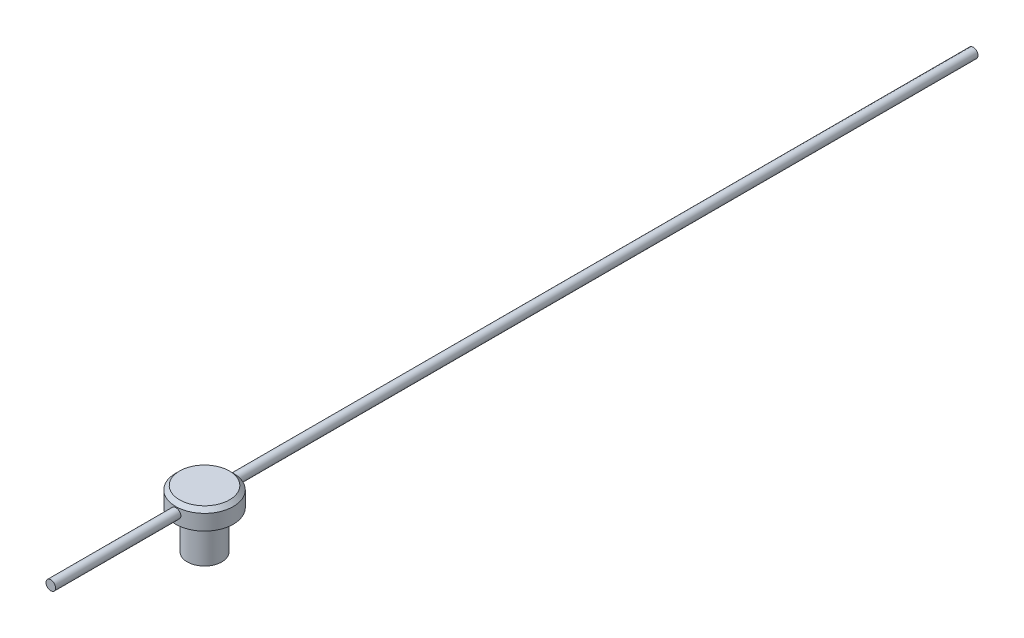
ISO-10303-21;
HEADER;
FILE_DESCRIPTION(('STEP AP214'),'2;1');
FILE_NAME('part.step','',(''),(''),'','','');
FILE_SCHEMA(('AUTOMOTIVE_DESIGN { 1 0 10303 214 1 1 1 1 }'));
ENDSEC;
DATA;
#1=APPLICATION_CONTEXT('core data for automotive mechanical design processes');
#2=APPLICATION_PROTOCOL_DEFINITION('international standard','automotive_design',2000,#1);
#3=PRODUCT_CONTEXT('',#1,'mechanical');
#4=PRODUCT('Part','Part','',(#3));
#5=PRODUCT_RELATED_PRODUCT_CATEGORY('part','',(#4));
#6=PRODUCT_DEFINITION_FORMATION('','',#4);
#7=PRODUCT_DEFINITION_CONTEXT('part definition',#1,'design');
#8=PRODUCT_DEFINITION('design','',#6,#7);
#9=PRODUCT_DEFINITION_SHAPE('','',#8);
#10=(LENGTH_UNIT() NAMED_UNIT(*) SI_UNIT(.MILLI.,.METRE.));
#11=(NAMED_UNIT(*) PLANE_ANGLE_UNIT() SI_UNIT($,.RADIAN.));
#12=(NAMED_UNIT(*) SI_UNIT($,.STERADIAN.) SOLID_ANGLE_UNIT());
#13=UNCERTAINTY_MEASURE_WITH_UNIT(LENGTH_MEASURE(1.E-05),#10,'distance_accuracy_value','');
#14=(GEOMETRIC_REPRESENTATION_CONTEXT(3) GLOBAL_UNCERTAINTY_ASSIGNED_CONTEXT((#13)) GLOBAL_UNIT_ASSIGNED_CONTEXT((#10,
#11,#12)) REPRESENTATION_CONTEXT('',''));
#15=CARTESIAN_POINT('',(0.,0.,0.));
#16=DIRECTION('',(0.,0.,1.));
#17=DIRECTION('',(1.,0.,0.));
#18=AXIS2_PLACEMENT_3D('',#15,#16,#17);
#19=CARTESIAN_POINT('',(0.,1.5,0.));
#20=DIRECTION('',(0.,-1.,0.));
#21=DIRECTION('',(0.,0.,-1.));
#22=AXIS2_PLACEMENT_3D('',#19,#20,#21);
#23=CYLINDRICAL_SURFACE('',#22,0.75);
#24=CARTESIAN_POINT('',(0.,1.4,0.));
#25=DIRECTION('',(0.,1.,0.));
#26=DIRECTION('',(0.,0.,1.));
#27=AXIS2_PLACEMENT_3D('',#24,#25,#26);
#28=CIRCLE('',#27,0.75);
#29=CARTESIAN_POINT('',(0.,1.4,0.75));
#30=VERTEX_POINT('',#29);
#31=EDGE_CURVE('E10',#30,#30,#28,.F.);
#32=ORIENTED_EDGE('',*,*,#31,.T.);
#33=EDGE_LOOP('',(#32));
#34=FACE_BOUND('',#33,.T.);
#35=CARTESIAN_POINT('',(-0.125,1.25,0.739509972887452));
#36=CARTESIAN_POINT('',(-0.12499971992105,1.2430312125927,0.739510098700638));
#37=CARTESIAN_POINT('',(-0.124415258451866,1.23605861969876,0.739609546274034));
#38=CARTESIAN_POINT('',(-0.12209387140377,1.22230907283899,0.739996228684089));
#39=CARTESIAN_POINT('',(-0.120355883015483,1.21553230531252,0.740283636695714));
#40=CARTESIAN_POINT('',(-0.115781477183357,1.20237538583216,0.741012804661162));
#41=CARTESIAN_POINT('',(-0.112945977746554,1.19599490756668,0.741454435585975));
#42=CARTESIAN_POINT('',(-0.106259324844518,1.18380095226431,0.74244213605717));
#43=CARTESIAN_POINT('',(-0.102408285675079,1.17798741152119,0.742988193848737));
#44=CARTESIAN_POINT('',(-0.093759376348315,1.16703435751272,0.744129235576304));
#45=CARTESIAN_POINT('',(-0.0889534524466137,1.16190124343067,0.744724608663534));
#46=CARTESIAN_POINT('',(-0.0785486002347671,1.15251033465692,0.745893740334729));
#47=CARTESIAN_POINT('',(-0.0729496249574996,1.14825259184423,0.746467497635986));
#48=CARTESIAN_POINT('',(-0.0610761434974171,1.14070927163903,0.747532868491235));
#49=CARTESIAN_POINT('',(-0.0547978040728353,1.13742964961341,0.748023971216138));
#50=CARTESIAN_POINT('',(-0.0417697810861937,1.13197394647347,0.748864368478577));
#51=CARTESIAN_POINT('',(-0.0350201282039095,1.12979779360576,0.749213672236337));
#52=CARTESIAN_POINT('',(-0.0213071863172121,1.1266303732508,0.74972836736219));
#53=CARTESIAN_POINT('',(-0.0143464443339635,1.12562835419977,0.749895426555452));
#54=CARTESIAN_POINT('',(-0.000353764276289913,1.12480421229237,0.750032539671391));
#55=CARTESIAN_POINT('',(0.00667816892644486,1.12498200923764,0.750002606984654));
#56=CARTESIAN_POINT('',(0.0205401092539437,1.12650406757641,0.749750429215694));
#57=CARTESIAN_POINT('',(0.027371426535007,1.12783675817046,0.749530091846198));
#58=CARTESIAN_POINT('',(0.0407120989805895,1.13161255371232,0.748923989385818));
#59=CARTESIAN_POINT('',(0.0472214443325751,1.13405569247948,0.748538219256606));
#60=CARTESIAN_POINT('',(0.0597678073891323,1.13999453201577,0.747641349255979));
#61=CARTESIAN_POINT('',(0.0658025261509523,1.14349500060412,0.74712968366344));
#62=CARTESIAN_POINT('',(0.0772032764923321,1.15144564113175,0.746037869035749));
#63=CARTESIAN_POINT('',(0.0825692538957938,1.15589588993554,0.745457714459567));
#64=CARTESIAN_POINT('',(0.0925485636723333,1.16568394033097,0.744285134116298));
#65=CARTESIAN_POINT('',(0.0971519751126604,1.17103185474505,0.743692644865521));
#66=CARTESIAN_POINT('',(0.105397729422403,1.18242935451079,0.742568979892403));
#67=CARTESIAN_POINT('',(0.109040063426621,1.18847894633414,0.742037804735663));
#68=CARTESIAN_POINT('',(0.115262221724414,1.20111958209387,0.741096877280908));
#69=CARTESIAN_POINT('',(0.117840851363962,1.2077112249046,0.740687261651301));
#70=CARTESIAN_POINT('',(0.121851493540781,1.22124245361538,0.74003809434494));
#71=CARTESIAN_POINT('',(0.123283607038398,1.22818200882162,0.739798527694161));
#72=CARTESIAN_POINT('',(0.124946594243963,1.24212330780811,0.739519479711058));
#73=CARTESIAN_POINT('',(0.125191610395622,1.2491233189851,0.739477642879335));
#74=CARTESIAN_POINT('',(0.124511135134123,1.26306433358454,0.739592517391181));
#75=CARTESIAN_POINT('',(0.123585688931233,1.2700053392757,0.739749221065927));
#76=CARTESIAN_POINT('',(0.120602616746405,1.28358638795954,0.740241343727509));
#77=CARTESIAN_POINT('',(0.118552189532319,1.2902280569939,0.740575625959174));
#78=CARTESIAN_POINT('',(0.113384909509614,1.30307350831397,0.741384286502751));
#79=CARTESIAN_POINT('',(0.110267992905047,1.30927726437754,0.74185867319529));
#80=CARTESIAN_POINT('',(0.103022833661462,1.32113372972031,0.742899564198697));
#81=CARTESIAN_POINT('',(0.0988855282079683,1.3267808286378,0.743466877800174));
#82=CARTESIAN_POINT('',(0.0897294732853992,1.33730567663475,0.744627333339933));
#83=CARTESIAN_POINT('',(0.0847106618192024,1.34218337155549,0.745220477092666));
#84=CARTESIAN_POINT('',(0.0738714035164406,1.35108259463644,0.746373211059132));
#85=CARTESIAN_POINT('',(0.0680431626693099,1.35509469131423,0.746932388172336));
#86=CARTESIAN_POINT('',(0.0557871723974664,1.36208276635024,0.747947556216471));
#87=CARTESIAN_POINT('',(0.0493594423735314,1.36505877822369,0.748403550484988));
#88=CARTESIAN_POINT('',(0.0361149525750665,1.36987552919774,0.749159179084792));
#89=CARTESIAN_POINT('',(0.0293000281301306,1.37172120378675,0.749459492283811));
#90=CARTESIAN_POINT('',(0.0154515367437107,1.37424077994819,0.749872791584641));
#91=CARTESIAN_POINT('',(0.00841798784108133,1.37491477793662,0.749985793100089));
#92=CARTESIAN_POINT('',(-0.00557706378868389,1.37506909411561,0.750011518943913));
#93=CARTESIAN_POINT('',(-0.0125384080301338,1.37456376269705,0.74992665101212));
#94=CARTESIAN_POINT('',(-0.0262755987157344,1.37240480388653,0.749571089193642));
#95=CARTESIAN_POINT('',(-0.0330514461983711,1.37075118292452,0.749300396347501));
#96=CARTESIAN_POINT('',(-0.0462198222959295,1.36634809172281,0.748603494413793));
#97=CARTESIAN_POINT('',(-0.052612768607701,1.36359984158948,0.748177458520777));
#98=CARTESIAN_POINT('',(-0.0648490226490981,1.35708710318849,0.747216378438676));
#99=CARTESIAN_POINT('',(-0.0706923043058731,1.35332256674695,0.746681329082441));
#100=CARTESIAN_POINT('',(-0.0817356472763579,1.3448332453769,0.745553814809486));
#101=CARTESIAN_POINT('',(-0.0869275715302806,1.34009795226216,0.744960762275367));
#102=CARTESIAN_POINT('',(-0.0964481937974021,1.32982358460509,0.743788151652376));
#103=CARTESIAN_POINT('',(-0.10077668933506,1.32428432205542,0.743208596756802));
#104=CARTESIAN_POINT('',(-0.108475713545981,1.31251273387462,0.742124171785049));
#105=CARTESIAN_POINT('',(-0.111839249454727,1.3062757830081,0.741619858990617));
#106=CARTESIAN_POINT('',(-0.117465726822045,1.29331953820443,0.740749605110885));
#107=CARTESIAN_POINT('',(-0.11972976776158,1.28660073386516,0.740383525875637));
#108=CARTESIAN_POINT('',(-0.122601302656107,1.27487981152617,0.73991237241889));
#109=CARTESIAN_POINT('',(-0.123499370883514,1.26994865960208,0.739762311710509));
#110=CARTESIAN_POINT('',(-0.124698814759121,1.26001232575794,0.73956106764326));
#111=CARTESIAN_POINT('',(-0.125000201239596,1.25500714518349,0.739509882489388));
#112=CARTESIAN_POINT('',(-0.125,1.25,0.739509972887452));
#113=B_SPLINE_CURVE_WITH_KNOTS('',3,(#35,#36,#37,#38,#39,#40,#41,#42,#43,#44,#45,#46,#47,#48,
#49,#50,#51,#52,#53,#54,#55,#56,#57,#58,#59,#60,#61,#62,#63,#64,#65,#66,#67,#68,#69,#70,#71,#72,
#73,#74,#75,#76,#77,#78,#79,#80,#81,#82,#83,#84,#85,#86,#87,#88,#89,#90,#91,#92,#93,#94,#95,#96,
#97,#98,#99,#100,#101,#102,#103,#104,#105,#106,#107,#108,#109,#110,#111,#112),.UNSPECIFIED.,.T.,
.F.,(4,2,2,2,2,2,2,2,2,2,2,2,2,2,2,2,2,2,2,2,2,2,2,2,2,2,2,2,2,2,2,2,2,2,2,2,2,2,4),(0.,
0.020888051945266,0.0417953759959723,0.0626852498915832,0.0835727737004609,0.104644579575681,
0.125717633915047,0.146916490053541,0.168113967553381,0.189115783734107,0.21011617232417,
0.230908560580158,0.25170158212259,0.272589802067537,0.293479713111206,0.314623061728886,
0.335766605370833,0.356933831247126,0.378099192966863,0.399011771208029,0.419923541704812,
0.440703032315569,0.461483766144611,0.482456171379175,0.503430052213169,0.524622056515515,
0.545813375236173,0.566911492206647,0.588007872953999,0.608848888130782,0.629689786607236,
0.650507519914052,0.671326240193992,0.69238349872945,0.71344568943873,0.734656863806425,
0.755846783368814,0.770855335268469,0.785863614697496),.UNSPECIFIED.);
#114=CARTESIAN_POINT('',(-0.125,1.25,0.739509972887452));
#115=VERTEX_POINT('',#114);
#116=EDGE_CURVE('E47',#115,#115,#113,.T.);
#117=ORIENTED_EDGE('',*,*,#116,.F.);
#118=EDGE_LOOP('',(#117));
#119=FACE_BOUND('',#118,.T.);
#120=CARTESIAN_POINT('',(0.,1.,0.));
#121=DIRECTION('',(0.,1.,0.));
#122=DIRECTION('',(0.,0.,1.));
#123=AXIS2_PLACEMENT_3D('',#120,#121,#122);
#124=CIRCLE('',#123,0.75);
#125=CARTESIAN_POINT('',(0.,1.,0.75));
#126=VERTEX_POINT('',#125);
#127=EDGE_CURVE('E95',#126,#126,#124,.T.);
#128=ORIENTED_EDGE('',*,*,#127,.T.);
#129=EDGE_LOOP('',(#128));
#130=FACE_BOUND('',#129,.T.);
#131=CARTESIAN_POINT('',(0.,1.375,-0.75));
#132=CARTESIAN_POINT('',(0.00696954524791075,1.37499972055261,-0.749999880584412));
#133=CARTESIAN_POINT('',(0.0139428940919411,1.37441513625155,-0.749901838956517));
#134=CARTESIAN_POINT('',(0.0276940110836521,1.37209321706173,-0.749520172470694));
#135=CARTESIAN_POINT('',(0.0344715933979624,1.37035482215442,-0.749236376961945));
#136=CARTESIAN_POINT('',(0.0476302373606323,1.36577922757036,-0.748515034118225));
#137=CARTESIAN_POINT('',(0.0540116184215952,1.36294292671797,-0.748077612579597));
#138=CARTESIAN_POINT('',(0.0662070920988974,1.35625438539738,-0.747097113541035));
#139=CARTESIAN_POINT('',(0.0720212494939296,1.35240226112585,-0.746554048127217));
#140=CARTESIAN_POINT('',(0.0829736307145841,1.34375224580898,-0.745416658729157));
#141=CARTESIAN_POINT('',(0.0881056451767485,1.33894654426819,-0.744821935907428));
#142=CARTESIAN_POINT('',(0.0974944249329965,1.32854260157636,-0.743651313438366));
#143=CARTESIAN_POINT('',(0.101751134969549,1.32294431042717,-0.743075414981334));
#144=CARTESIAN_POINT('',(0.109293356280257,1.31107145169015,-0.74200378287989));
#145=CARTESIAN_POINT('',(0.11257272764305,1.30479293315976,-0.741508564545818));
#146=CARTESIAN_POINT('',(0.118027918270561,1.29176452178497,-0.740659894897338));
#147=CARTESIAN_POINT('',(0.120203812078281,1.28501466081612,-0.740306434007154));
#148=CARTESIAN_POINT('',(0.12337071888924,1.27130098625717,-0.739785268421378));
#149=CARTESIAN_POINT('',(0.12437245145677,1.26433971317493,-0.73961588424285));
#150=CARTESIAN_POINT('',(0.125195836264494,1.25034598615583,-0.739476969468325));
#151=CARTESIAN_POINT('',(0.12501757201945,1.24331353729164,-0.739507424728607));
#152=CARTESIAN_POINT('',(0.123494754919808,1.22945360693623,-0.739763214431778));
#153=CARTESIAN_POINT('',(0.122162244094489,1.22262475982274,-0.739986536659458));
#154=CARTESIAN_POINT('',(0.118387657020172,1.20928893410854,-0.740599747605504));
#155=CARTESIAN_POINT('',(0.115945542715987,1.20278196655557,-0.740989642036636));
#156=CARTESIAN_POINT('',(0.110008862304696,1.19023855882795,-0.74189423966705));
#157=CARTESIAN_POINT('',(0.106509295693986,1.18420452969594,-0.742409533553663));
#158=CARTESIAN_POINT('',(0.0985606008778717,1.17280477997308,-0.743506459207505));
#159=CARTESIAN_POINT('',(0.0941113960327143,1.16743911337725,-0.744088096327143));
#160=CARTESIAN_POINT('',(0.0843241106079526,1.15745869570963,-0.745261013939893));
#161=CARTESIAN_POINT('',(0.0789756981936563,1.152854074073,-0.745852324615826));
#162=CARTESIAN_POINT('',(0.0675767624490823,1.14460611186673,-0.746971300698362));
#163=CARTESIAN_POINT('',(0.0615262345953211,1.14096277749084,-0.747498965694873));
#164=CARTESIAN_POINT('',(0.0488852958083355,1.13473988864319,-0.748431946446456));
#165=CARTESIAN_POINT('',(0.042294436278233,1.13216122903344,-0.748837159203724));
#166=CARTESIAN_POINT('',(0.0287649172801365,1.1281502892377,-0.74947875150633));
#167=CARTESIAN_POINT('',(0.0218262869589733,1.12671791315131,-0.749715145175237));
#168=CARTESIAN_POINT('',(0.00788549506508107,1.12505393207694,-0.749990564921343));
#169=CARTESIAN_POINT('',(0.000885036857550468,1.12480842140972,-0.750031876506392));
#170=CARTESIAN_POINT('',(-0.0130569886444945,1.12548806722141,-0.749918737210585));
#171=CARTESIAN_POINT('',(-0.019998558194602,1.12641317865669,-0.749764293862059));
#172=CARTESIAN_POINT('',(-0.0335828087773383,1.12939624246677,-0.749278413469101));
#173=CARTESIAN_POINT('',(-0.040227043419269,1.13144731041951,-0.748948052400656));
#174=CARTESIAN_POINT('',(-0.0530773442430222,1.13661672590998,-0.748147232227679));
#175=CARTESIAN_POINT('',(-0.059283385795486,1.13973513338176,-0.74767676525601));
#176=CARTESIAN_POINT('',(-0.071141534473448,1.14698255623484,-0.746642258151204));
#177=CARTESIAN_POINT('',(-0.0767882625468575,1.15112025780836,-0.746077427943511));
#178=CARTESIAN_POINT('',(-0.0873121792751345,1.16027686576925,-0.74491923369595));
#179=CARTESIAN_POINT('',(-0.0921893119848292,1.16529583616383,-0.744325867585773));
#180=CARTESIAN_POINT('',(-0.1010871389829,1.17613487740357,-0.743170087617923));
#181=CARTESIAN_POINT('',(-0.105098438055686,1.18196270827572,-0.742608058068553));
#182=CARTESIAN_POINT('',(-0.112085115514749,1.19421764845693,-0.741585764888942));
#183=CARTESIAN_POINT('',(-0.115060526738491,1.20064473876137,-0.74112549803301));
#184=CARTESIAN_POINT('',(-0.119876916573657,1.21388948664061,-0.740361726848852));
#185=CARTESIAN_POINT('',(-0.121722571627397,1.22070540475152,-0.740057577155532));
#186=CARTESIAN_POINT('',(-0.124241772688914,1.23455600646109,-0.739638858417631));
#187=CARTESIAN_POINT('',(-0.124915420597308,1.2415906709866,-0.739524272891361));
#188=CARTESIAN_POINT('',(-0.125068643302368,1.25558525829812,-0.739498366542006));
#189=CARTESIAN_POINT('',(-0.124563006806259,1.26254501892876,-0.739584528252825));
#190=CARTESIAN_POINT('',(-0.122403991947842,1.27627896240254,-0.739944890726864));
#191=CARTESIAN_POINT('',(-0.120750617305624,1.28305314584709,-0.740219090880607));
#192=CARTESIAN_POINT('',(-0.116348724479745,1.29621792186463,-0.740923678140859));
#193=CARTESIAN_POINT('',(-0.113601479530022,1.3026089505028,-0.741353883609835));
#194=CARTESIAN_POINT('',(-0.107091350195796,1.31484178345974,-0.742322184461104));
#195=CARTESIAN_POINT('',(-0.103328415437428,1.32068356051861,-0.7428602851942));
#196=CARTESIAN_POINT('',(-0.0948409442186078,1.33172677915539,-0.743991727022811));
#197=CARTESIAN_POINT('',(-0.0901055281796824,1.33691980083501,-0.744585647788151));
#198=CARTESIAN_POINT('',(-0.0798304515690115,1.34644258022375,-0.74575718618042));
#199=CARTESIAN_POINT('',(-0.0742906056456318,1.35077213843191,-0.746334800013273));
#200=CARTESIAN_POINT('',(-0.062518458482014,1.35847241341,-0.74741326482111));
#201=CARTESIAN_POINT('',(-0.0562816393766408,1.36183630196565,-0.747913558126552));
#202=CARTESIAN_POINT('',(-0.0433256534689489,1.3674634742305,-0.748775583800888));
#203=CARTESIAN_POINT('',(-0.0366069747415004,1.36972785405399,-0.749137454088741));
#204=CARTESIAN_POINT('',(-0.02488516550227,1.37260026370633,-0.749602895416478));
#205=CARTESIAN_POINT('',(-0.0199529415149223,1.3734987234808,-0.749751013636679));
#206=CARTESIAN_POINT('',(-0.0100144655159904,1.37469868689224,-0.749949607993061));
#207=CARTESIAN_POINT('',(-0.0050082147804247,1.37500020080687,-0.750000085810321));
#208=CARTESIAN_POINT('',(0.,1.375,-0.75));
#209=B_SPLINE_CURVE_WITH_KNOTS('',3,(#131,#132,#133,#134,#135,#136,#137,#138,#139,#140,#141,
#142,#143,#144,#145,#146,#147,#148,#149,#150,#151,#152,#153,#154,#155,#156,#157,#158,#159,#160,
#161,#162,#163,#164,#165,#166,#167,#168,#169,#170,#171,#172,#173,#174,#175,#176,#177,#178,#179,
#180,#181,#182,#183,#184,#185,#186,#187,#188,#189,#190,#191,#192,#193,#194,#195,#196,#197,#198,
#199,#200,#201,#202,#203,#204,#205,#206,#207,#208),.UNSPECIFIED.,.T.,.F.,(4,2,2,2,2,2,2,2,2,2,2,
2,2,2,2,2,2,2,2,2,2,2,2,2,2,2,2,2,2,2,2,2,2,2,2,2,2,2,4),(0.,0.0208903292469255,
0.041799877284771,0.0626923433512637,0.0835824206337395,0.104651245531166,0.125721400084928,
0.14692126041192,0.168119688438091,0.189123038551712,0.210124902160443,0.230910260880204,
0.25169633251269,0.272582278316279,0.293469910340287,0.314616384955663,0.335762995817924,
0.356927344457952,0.378089922260575,0.399003941745699,0.41991715651793,0.440703903503208,
0.461491817913033,0.482463412813512,0.503436531527142,0.52462691100381,0.545816618687971,
0.566918011170886,0.588017568893309,0.60885395476135,0.629690273094066,0.650502409113112,
0.671315577514668,0.692375692096696,0.713440666939487,0.7346511158036,0.755840376065036,
0.770852124082009,0.785863613638484),.UNSPECIFIED.);
#210=CARTESIAN_POINT('',(0.,1.375,-0.75));
#211=VERTEX_POINT('',#210);
#212=EDGE_CURVE('E43',#211,#211,#209,.T.);
#213=ORIENTED_EDGE('',*,*,#212,.F.);
#214=EDGE_LOOP('',(#213));
#215=FACE_BOUND('',#214,.T.);
#216=ADVANCED_FACE('F32',(#34,#119,#130,#215),#23,.T.);
#217=CARTESIAN_POINT('',(0.,1.,0.));
#218=DIRECTION('',(0.,-1.,0.));
#219=DIRECTION('',(0.,0.,-1.));
#220=AXIS2_PLACEMENT_3D('',#217,#218,#219);
#221=CYLINDRICAL_SURFACE('',#220,0.45);
#222=CARTESIAN_POINT('',(0.,1.,0.));
#223=DIRECTION('',(0.,1.,0.));
#224=DIRECTION('',(0.,0.,1.));
#225=AXIS2_PLACEMENT_3D('',#222,#223,#224);
#226=CIRCLE('',#225,0.45);
#227=CARTESIAN_POINT('',(0.,1.,0.45));
#228=VERTEX_POINT('',#227);
#229=EDGE_CURVE('E102',#228,#228,#226,.T.);
#230=ORIENTED_EDGE('',*,*,#229,.F.);
#231=EDGE_LOOP('',(#230));
#232=FACE_BOUND('',#231,.T.);
#233=CARTESIAN_POINT('',(0.,0.,0.));
#234=DIRECTION('',(0.,1.,0.));
#235=DIRECTION('',(0.,0.,1.));
#236=AXIS2_PLACEMENT_3D('',#233,#234,#235);
#237=CIRCLE('',#236,0.45);
#238=CARTESIAN_POINT('',(0.,0.,0.45));
#239=VERTEX_POINT('',#238);
#240=EDGE_CURVE('E98',#239,#239,#237,.T.);
#241=ORIENTED_EDGE('',*,*,#240,.T.);
#242=EDGE_LOOP('',(#241));
#243=FACE_BOUND('',#242,.T.);
#244=ADVANCED_FACE('F80',(#232,#243),#221,.T.);
#245=CARTESIAN_POINT('',(0.,0.,0.));
#246=DIRECTION('',(0.,1.,0.));
#247=DIRECTION('',(0.,0.,1.));
#248=AXIS2_PLACEMENT_3D('',#245,#246,#247);
#249=PLANE('',#248);
#250=ORIENTED_EDGE('',*,*,#240,.F.);
#251=EDGE_LOOP('',(#250));
#252=FACE_BOUND('',#251,.T.);
#253=ADVANCED_FACE('F75',(#252),#249,.F.);
#254=CARTESIAN_POINT('',(0.,1.,0.));
#255=DIRECTION('',(0.,1.,0.));
#256=DIRECTION('',(0.,0.,1.));
#257=AXIS2_PLACEMENT_3D('',#254,#255,#256);
#258=PLANE('',#257);
#259=ORIENTED_EDGE('',*,*,#127,.F.);
#260=EDGE_LOOP('',(#259));
#261=FACE_BOUND('',#260,.T.);
#262=ORIENTED_EDGE('',*,*,#229,.T.);
#263=EDGE_LOOP('',(#262));
#264=FACE_BOUND('',#263,.T.);
#265=ADVANCED_FACE('F73',(#261,#264),#258,.F.);
#266=CARTESIAN_POINT('',(0.,1.5,0.));
#267=DIRECTION('',(0.,1.,0.));
#268=DIRECTION('',(0.,0.,1.));
#269=AXIS2_PLACEMENT_3D('',#266,#267,#268);
#270=PLANE('',#269);
#271=CARTESIAN_POINT('',(0.,1.5,0.));
#272=DIRECTION('',(0.,1.,0.));
#273=DIRECTION('',(0.,0.,1.));
#274=AXIS2_PLACEMENT_3D('',#271,#272,#273);
#275=CIRCLE('',#274,0.650000000000001);
#276=CARTESIAN_POINT('',(0.,1.5,0.650000000000001));
#277=VERTEX_POINT('',#276);
#278=EDGE_CURVE('E39',#277,#277,#275,.T.);
#279=ORIENTED_EDGE('',*,*,#278,.T.);
#280=EDGE_LOOP('',(#279));
#281=FACE_BOUND('',#280,.T.);
#282=ADVANCED_FACE('F70',(#281),#270,.T.);
#283=CARTESIAN_POINT('',(0.,1.25,4.));
#284=DIRECTION('',(0.,0.,1.));
#285=DIRECTION('',(1.,0.,0.));
#286=AXIS2_PLACEMENT_3D('',#283,#284,#285);
#287=PLANE('',#286);
#288=CARTESIAN_POINT('',(0.,1.25,4.));
#289=DIRECTION('',(0.,0.,1.));
#290=DIRECTION('',(1.,0.,0.));
#291=AXIS2_PLACEMENT_3D('',#288,#289,#290);
#292=CIRCLE('',#291,0.125);
#293=CARTESIAN_POINT('',(0.125,1.25,4.));
#294=VERTEX_POINT('',#293);
#295=EDGE_CURVE('E99',#294,#294,#292,.T.);
#296=ORIENTED_EDGE('',*,*,#295,.T.);
#297=EDGE_LOOP('',(#296));
#298=FACE_BOUND('',#297,.T.);
#299=ADVANCED_FACE('F68',(#298),#287,.T.);
#300=CARTESIAN_POINT('',(0.,1.25,4.));
#301=DIRECTION('',(0.,0.,-1.));
#302=DIRECTION('',(-1.,0.,0.));
#303=AXIS2_PLACEMENT_3D('',#300,#301,#302);
#304=CYLINDRICAL_SURFACE('',#303,0.125);
#305=ORIENTED_EDGE('',*,*,#295,.F.);
#306=EDGE_LOOP('',(#305));
#307=FACE_BOUND('',#306,.T.);
#308=ORIENTED_EDGE('',*,*,#116,.T.);
#309=EDGE_LOOP('',(#308));
#310=FACE_BOUND('',#309,.T.);
#311=ADVANCED_FACE('F66',(#307,#310),#304,.T.);
#312=CARTESIAN_POINT('',(0.,1.25,-20.));
#313=DIRECTION('',(0.,0.,1.));
#314=DIRECTION('',(1.,0.,0.));
#315=AXIS2_PLACEMENT_3D('',#312,#313,#314);
#316=CIRCLE('',#315,0.125);
#317=CARTESIAN_POINT('',(0.125,1.25,-20.));
#318=VERTEX_POINT('',#317);
#319=EDGE_CURVE('E104',#318,#318,#316,.T.);
#320=ORIENTED_EDGE('',*,*,#319,.T.);
#321=EDGE_LOOP('',(#320));
#322=FACE_BOUND('',#321,.T.);
#323=ORIENTED_EDGE('',*,*,#212,.T.);
#324=EDGE_LOOP('',(#323));
#325=FACE_BOUND('',#324,.T.);
#326=ADVANCED_FACE('F60',(#322,#325),#304,.T.);
#327=CARTESIAN_POINT('',(0.,1.25,-20.));
#328=DIRECTION('',(0.,0.,1.));
#329=DIRECTION('',(1.,0.,0.));
#330=AXIS2_PLACEMENT_3D('',#327,#328,#329);
#331=PLANE('',#330);
#332=ORIENTED_EDGE('',*,*,#319,.F.);
#333=EDGE_LOOP('',(#332));
#334=FACE_BOUND('',#333,.T.);
#335=ADVANCED_FACE('F65',(#334),#331,.F.);
#336=CARTESIAN_POINT('',(0.,1.5,0.));
#337=DIRECTION('',(0.,-1.,0.));
#338=DIRECTION('',(0.,0.,-1.));
#339=AXIS2_PLACEMENT_3D('',#336,#337,#338);
#340=CONICAL_SURFACE('',#339,0.650000000000001,0.785398163397454);
#341=ORIENTED_EDGE('',*,*,#31,.F.);
#342=EDGE_LOOP('',(#341));
#343=FACE_BOUND('',#342,.T.);
#344=ORIENTED_EDGE('',*,*,#278,.F.);
#345=EDGE_LOOP('',(#344));
#346=FACE_BOUND('',#345,.T.);
#347=ADVANCED_FACE('F34',(#343,#346),#340,.T.);
#348=CLOSED_SHELL('',(#216,#244,#253,#265,#282,#299,#311,#326,#335,#347));
#349=MANIFOLD_SOLID_BREP('B2',#348);
#350=ADVANCED_BREP_SHAPE_REPRESENTATION('',(#18,#349),#14);
#351=SHAPE_DEFINITION_REPRESENTATION(#9,#350);
ENDSEC;
END-ISO-10303-21;
